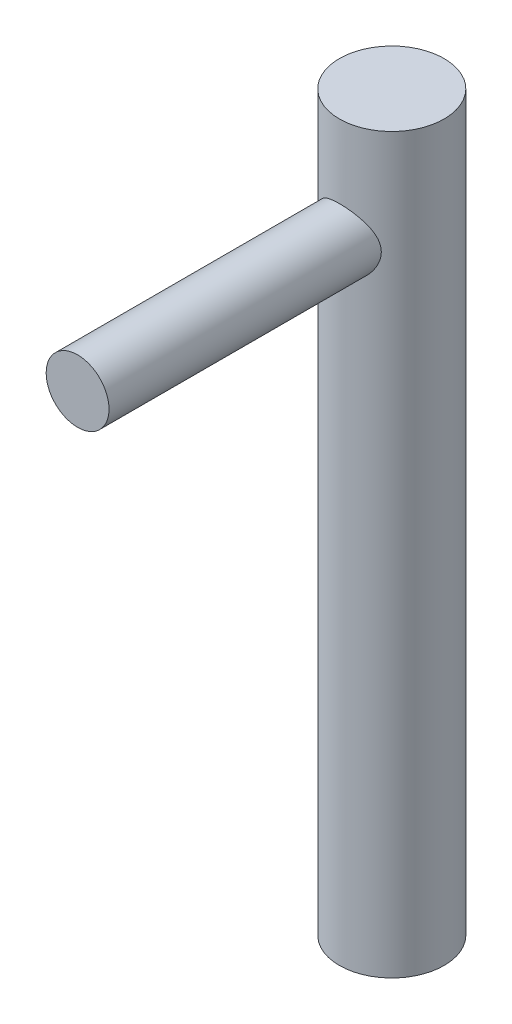
ISO-10303-21;
HEADER;
FILE_DESCRIPTION(('STEP AP214'),'2;1');
FILE_NAME('part.step','',(''),(''),'','','');
FILE_SCHEMA(('AUTOMOTIVE_DESIGN { 1 0 10303 214 1 1 1 1 }'));
ENDSEC;
DATA;
#1=APPLICATION_CONTEXT('core data for automotive mechanical design processes');
#2=APPLICATION_PROTOCOL_DEFINITION('international standard','automotive_design',2000,#1);
#3=PRODUCT_CONTEXT('',#1,'mechanical');
#4=PRODUCT('Part','Part','',(#3));
#5=PRODUCT_RELATED_PRODUCT_CATEGORY('part','',(#4));
#6=PRODUCT_DEFINITION_FORMATION('','',#4);
#7=PRODUCT_DEFINITION_CONTEXT('part definition',#1,'design');
#8=PRODUCT_DEFINITION('design','',#6,#7);
#9=PRODUCT_DEFINITION_SHAPE('','',#8);
#10=(LENGTH_UNIT() NAMED_UNIT(*) SI_UNIT(.MILLI.,.METRE.));
#11=(NAMED_UNIT(*) PLANE_ANGLE_UNIT() SI_UNIT($,.RADIAN.));
#12=(NAMED_UNIT(*) SI_UNIT($,.STERADIAN.) SOLID_ANGLE_UNIT());
#13=UNCERTAINTY_MEASURE_WITH_UNIT(LENGTH_MEASURE(1.E-05),#10,'distance_accuracy_value','');
#14=(GEOMETRIC_REPRESENTATION_CONTEXT(3) GLOBAL_UNCERTAINTY_ASSIGNED_CONTEXT((#13)) GLOBAL_UNIT_ASSIGNED_CONTEXT((#10,
#11,#12)) REPRESENTATION_CONTEXT('',''));
#15=CARTESIAN_POINT('',(0.,0.,0.));
#16=DIRECTION('',(0.,0.,1.));
#17=DIRECTION('',(1.,0.,0.));
#18=AXIS2_PLACEMENT_3D('',#15,#16,#17);
#19=CARTESIAN_POINT('',(0.,35.,0.));
#20=DIRECTION('',(0.,-1.,0.));
#21=DIRECTION('',(0.,0.,-1.));
#22=AXIS2_PLACEMENT_3D('',#19,#20,#21);
#23=CYLINDRICAL_SURFACE('',#22,2.5);
#24=CARTESIAN_POINT('',(0.,35.,0.));
#25=DIRECTION('',(0.,1.,0.));
#26=DIRECTION('',(0.,0.,1.));
#27=AXIS2_PLACEMENT_3D('',#24,#25,#26);
#28=CIRCLE('',#27,2.5);
#29=CARTESIAN_POINT('',(0.,35.,2.5));
#30=VERTEX_POINT('',#29);
#31=EDGE_CURVE('E46',#30,#30,#28,.T.);
#32=ORIENTED_EDGE('',*,*,#31,.F.);
#33=EDGE_LOOP('',(#32));
#34=FACE_BOUND('',#33,.T.);
#35=CARTESIAN_POINT('',(0.,0.,0.));
#36=DIRECTION('',(0.,1.,0.));
#37=DIRECTION('',(0.,0.,1.));
#38=AXIS2_PLACEMENT_3D('',#35,#36,#37);
#39=CIRCLE('',#38,2.5);
#40=CARTESIAN_POINT('',(0.,0.,2.5));
#41=VERTEX_POINT('',#40);
#42=EDGE_CURVE('E50',#41,#41,#39,.T.);
#43=ORIENTED_EDGE('',*,*,#42,.T.);
#44=EDGE_LOOP('',(#43));
#45=FACE_BOUND('',#44,.T.);
#46=CARTESIAN_POINT('',(-1.5,30.,2.));
#47=CARTESIAN_POINT('',(-1.50000404108592,29.9245210247104,1.99999416642511));
#48=CARTESIAN_POINT('',(-1.49426852824014,29.8490615659202,2.00433633903481));
#49=CARTESIAN_POINT('',(-1.47174965152788,29.7006760960378,2.02092590613883));
#50=CARTESIAN_POINT('',(-1.45495475788936,29.6277528126149,2.03318155043097));
#51=CARTESIAN_POINT('',(-1.41143486335796,29.4869163583227,2.0636233903473));
#52=CARTESIAN_POINT('',(-1.3847815450315,29.4189711619647,2.08176666183119));
#53=CARTESIAN_POINT('',(-1.3225290928302,29.2885625466321,2.12185904995836));
#54=CARTESIAN_POINT('',(-1.28692729054694,29.2261007703049,2.14380930122416));
#55=CARTESIAN_POINT('',(-1.20271292747644,29.1000509833359,2.19228594587542));
#56=CARTESIAN_POINT('',(-1.15304179435289,29.0372590428761,2.21904371037662));
#57=CARTESIAN_POINT('',(-1.04426801309985,28.9202352372583,2.2722622943106));
#58=CARTESIAN_POINT('',(-0.985158296729614,28.8660098483292,2.29872287517103));
#59=CARTESIAN_POINT('',(-0.851442367411702,28.7618661902903,2.35175567858734));
#60=CARTESIAN_POINT('',(-0.775851995162549,28.7130455363302,2.37803133577818));
#61=CARTESIAN_POINT('',(-0.615654228271659,28.6291902775556,2.42443786983179));
#62=CARTESIAN_POINT('',(-0.53105519662633,28.5941430258773,2.44457437988735));
#63=CARTESIAN_POINT('',(-0.363771406742665,28.5424040771873,2.4747098780044));
#64=CARTESIAN_POINT('',(-0.281674698130914,28.5242796390327,2.4854930393917));
#65=CARTESIAN_POINT('',(-0.114970509382707,28.5020571971369,2.49874939277545));
#66=CARTESIAN_POINT('',(-0.0303654624001526,28.4979460219999,2.50123038813307));
#67=CARTESIAN_POINT('',(0.12763728373731,28.5036137473425,2.49783372711539));
#68=CARTESIAN_POINT('',(0.201123832865635,28.5117335261693,2.49295437513726));
#69=CARTESIAN_POINT('',(0.345464269151768,28.5384797956481,2.47707997553857));
#70=CARTESIAN_POINT('',(0.416317961051202,28.5571070639072,2.46608447529309));
#71=CARTESIAN_POINT('',(0.55405678046908,28.6041655627038,2.43884907201719));
#72=CARTESIAN_POINT('',(0.620916491037618,28.632653061139,2.42257910450824));
#73=CARTESIAN_POINT('',(0.748988660115612,28.6983846162255,2.38609637638748));
#74=CARTESIAN_POINT('',(0.810199646208012,28.735630947059,2.36588259201812));
#75=CARTESIAN_POINT('',(0.933074267143201,28.8228390928045,2.32037925976362));
#76=CARTESIAN_POINT('',(0.993918663198194,28.8737883117357,2.2947718295215));
#77=CARTESIAN_POINT('',(1.10671465909275,28.9844041178602,2.24255554245601));
#78=CARTESIAN_POINT('',(1.1586540130834,29.0440825034745,2.21594536703375));
#79=CARTESIAN_POINT('',(1.25824837767417,29.1786534061636,2.16111075123945));
#80=CARTESIAN_POINT('',(1.30470933188632,29.2545075765395,2.13305661385124));
#81=CARTESIAN_POINT('',(1.38397217194232,29.4147062316366,2.08250879557267));
#82=CARTESIAN_POINT('',(1.41679921962189,29.4990347161256,2.0600049029882));
#83=CARTESIAN_POINT('',(1.46077497064843,29.6523936318954,2.02895865196731));
#84=CARTESIAN_POINT('',(1.47527903312665,29.7200406322966,2.01833888618315));
#85=CARTESIAN_POINT('',(1.49480872755284,29.8573736102995,2.00392150777558));
#86=CARTESIAN_POINT('',(1.49984538302907,29.9270571204846,2.00011596115116));
#87=CARTESIAN_POINT('',(1.50014781114183,30.0665516824357,1.99988914321323));
#88=CARTESIAN_POINT('',(1.49540004697659,30.1363627772152,2.00347810223984));
#89=CARTESIAN_POINT('',(1.47640290574941,30.2739873437486,2.01751520788652));
#90=CARTESIAN_POINT('',(1.4621460183014,30.3417991922403,2.02796877613213));
#91=CARTESIAN_POINT('',(1.42488312618657,30.4737145794798,2.054317683331));
#92=CARTESIAN_POINT('',(1.40188805257362,30.5378226365322,2.07020622092812));
#93=CARTESIAN_POINT('',(1.34796261057072,30.6614777157302,2.10571539417587));
#94=CARTESIAN_POINT('',(1.31702924888212,30.721023006366,2.12533743689999));
#95=CARTESIAN_POINT('',(1.24167439558512,30.8452400825123,2.17036819177737));
#96=CARTESIAN_POINT('',(1.19582663060302,30.9089008350966,2.19618239397369));
#97=CARTESIAN_POINT('',(1.09487395518701,31.0282854848495,2.24821754803621));
#98=CARTESIAN_POINT('',(1.03976018672402,31.0840016921691,2.27443886711455));
#99=CARTESIAN_POINT('',(0.913274837212766,31.1932240073504,2.32835625910913));
#100=CARTESIAN_POINT('',(0.84072110878019,31.2455007266058,2.3558007587587));
#101=CARTESIAN_POINT('',(0.686103100868017,31.3369027768367,2.40537639133459));
#102=CARTESIAN_POINT('',(0.6040451761347,31.3760368278409,2.42751104449411));
#103=CARTESIAN_POINT('',(0.438840232972136,31.4368682034314,2.46252280092775));
#104=CARTESIAN_POINT('',(0.356205963651256,31.4596262277911,2.47595588067329));
#105=CARTESIAN_POINT('',(0.187383063890855,31.4907146028463,2.494407389061));
#106=CARTESIAN_POINT('',(0.101198571781966,31.4990612907176,2.49943534582737));
#107=CARTESIAN_POINT('',(-0.0598120232009864,31.5006746085859,2.50040600461976));
#108=CARTESIAN_POINT('',(-0.134620583589708,31.495803334563,2.49747057186327));
#109=CARTESIAN_POINT('',(-0.282148755978776,31.4751061756184,2.48512948412095));
#110=CARTESIAN_POINT('',(-0.354868344701917,31.4592801686784,2.47572375706639));
#111=CARTESIAN_POINT('',(-0.4951454819788,31.4177804284162,2.45149427526962));
#112=CARTESIAN_POINT('',(-0.562767032608834,31.3922684038708,2.43675966858906));
#113=CARTESIAN_POINT('',(-0.692781971999989,31.3323594054452,2.40303337447155));
#114=CARTESIAN_POINT('',(-0.755174184199837,31.2979604391404,2.38404073252268));
#115=CARTESIAN_POINT('',(-0.880263645295951,31.2170748034312,2.3409343265938));
#116=CARTESIAN_POINT('',(-0.942258690439942,31.1696812909831,2.31648844639149));
#117=CARTESIAN_POINT('',(-1.05789751536307,31.0662469662823,2.26601907350661));
#118=CARTESIAN_POINT('',(-1.11153190956916,31.0101965743921,2.23999385274509));
#119=CARTESIAN_POINT('',(-1.2159097535057,30.8827144378223,2.18528165666204));
#120=CARTESIAN_POINT('',(-1.26542406663368,30.8102335138345,2.15667566270901));
#121=CARTESIAN_POINT('',(-1.35156817210325,30.6565151472335,2.10376464485145));
#122=CARTESIAN_POINT('',(-1.38820466322661,30.5752822860186,2.07945738811052));
#123=CARTESIAN_POINT('',(-1.44437116535132,30.4129357148628,2.0408000304796));
#124=CARTESIAN_POINT('',(-1.46509526060188,30.3324047640388,2.02577665830138));
#125=CARTESIAN_POINT('',(-1.49289268240427,30.1679026052963,2.00539032320036));
#126=CARTESIAN_POINT('',(-1.49999550595837,30.0839392342413,2.00000648744643));
#127=CARTESIAN_POINT('',(-1.5,30.,2.));
#128=B_SPLINE_CURVE_WITH_KNOTS('',3,(#46,#47,#48,#49,#50,#51,#52,#53,#54,#55,#56,#57,#58,#59,
#60,#61,#62,#63,#64,#65,#66,#67,#68,#69,#70,#71,#72,#73,#74,#75,#76,#77,#78,#79,#80,#81,#82,#83,
#84,#85,#86,#87,#88,#89,#90,#91,#92,#93,#94,#95,#96,#97,#98,#99,#100,#101,#102,#103,#104,#105,
#106,#107,#108,#109,#110,#111,#112,#113,#114,#115,#116,#117,#118,#119,#120,#121,#122,#123,#124,
#125,#126,#127),.UNSPECIFIED.,.T.,.F.,(4,2,2,2,2,2,2,2,2,2,2,2,2,2,2,2,2,2,2,2,2,2,2,2,2,2,2,2,
2,2,2,2,2,2,2,2,2,2,2,2,4),(0.,0.22608524949339,0.452406574330771,0.677113624991876,
0.90188776221593,1.15414462390001,1.40659128601844,1.68630157736223,1.9657544327122,
2.21853330858498,2.47107452602767,2.69230130543182,2.91354445887945,3.13607155036377,
3.35865648368879,3.60782810055849,3.85733966656909,4.13576671140277,4.41367760154769,
4.62276298054685,4.83160475643977,5.04073566011182,5.25003193304129,5.45906724365496,
5.66818149154662,5.91499438482003,6.16204457978455,6.4412182801159,6.72020638384849,
6.97891479383338,7.23732973022727,7.461293218494,7.68525920139649,7.90563970188757,
8.12606965394586,8.37042963549488,8.61506198741956,8.89071695766605,9.16622832484807,
9.41820120134355,9.66962780912278),.UNSPECIFIED.);
#129=CARTESIAN_POINT('',(-1.5,30.,2.));
#130=VERTEX_POINT('',#129);
#131=EDGE_CURVE('E10',#130,#130,#128,.T.);
#132=ORIENTED_EDGE('',*,*,#131,.F.);
#133=EDGE_LOOP('',(#132));
#134=FACE_BOUND('',#133,.T.);
#135=ADVANCED_FACE('F35',(#34,#45,#134),#23,.T.);
#136=CARTESIAN_POINT('',(0.,35.,0.));
#137=DIRECTION('',(0.,1.,0.));
#138=DIRECTION('',(0.,0.,1.));
#139=AXIS2_PLACEMENT_3D('',#136,#137,#138);
#140=PLANE('',#139);
#141=ORIENTED_EDGE('',*,*,#31,.T.);
#142=EDGE_LOOP('',(#141));
#143=FACE_BOUND('',#142,.T.);
#144=ADVANCED_FACE('F70',(#143),#140,.T.);
#145=CARTESIAN_POINT('',(0.,0.,0.));
#146=DIRECTION('',(0.,1.,0.));
#147=DIRECTION('',(0.,0.,1.));
#148=AXIS2_PLACEMENT_3D('',#145,#146,#147);
#149=PLANE('',#148);
#150=ORIENTED_EDGE('',*,*,#42,.F.);
#151=EDGE_LOOP('',(#150));
#152=FACE_BOUND('',#151,.T.);
#153=ADVANCED_FACE('F64',(#152),#149,.F.);
#154=CARTESIAN_POINT('',(0.,30.,15.));
#155=DIRECTION('',(0.,0.,-1.));
#156=DIRECTION('',(-1.,0.,0.));
#157=AXIS2_PLACEMENT_3D('',#154,#155,#156);
#158=CYLINDRICAL_SURFACE('',#157,1.5);
#159=CARTESIAN_POINT('',(0.,30.,15.));
#160=DIRECTION('',(0.,0.,1.));
#161=DIRECTION('',(1.,0.,0.));
#162=AXIS2_PLACEMENT_3D('',#159,#160,#161);
#163=CIRCLE('',#162,1.5);
#164=CARTESIAN_POINT('',(1.5,30.,15.));
#165=VERTEX_POINT('',#164);
#166=EDGE_CURVE('E55',#165,#165,#163,.T.);
#167=ORIENTED_EDGE('',*,*,#166,.F.);
#168=EDGE_LOOP('',(#167));
#169=FACE_BOUND('',#168,.T.);
#170=ORIENTED_EDGE('',*,*,#131,.T.);
#171=EDGE_LOOP('',(#170));
#172=FACE_BOUND('',#171,.T.);
#173=ADVANCED_FACE('F62',(#169,#172),#158,.T.);
#174=CARTESIAN_POINT('',(0.,30.,15.));
#175=DIRECTION('',(0.,0.,1.));
#176=DIRECTION('',(1.,0.,0.));
#177=AXIS2_PLACEMENT_3D('',#174,#175,#176);
#178=PLANE('',#177);
#179=ORIENTED_EDGE('',*,*,#166,.T.);
#180=EDGE_LOOP('',(#179));
#181=FACE_BOUND('',#180,.T.);
#182=ADVANCED_FACE('F60',(#181),#178,.T.);
#183=CLOSED_SHELL('',(#135,#144,#153,#173,#182));
#184=MANIFOLD_SOLID_BREP('B2',#183);
#185=ADVANCED_BREP_SHAPE_REPRESENTATION('',(#18,#184),#14);
#186=SHAPE_DEFINITION_REPRESENTATION(#9,#185);
ENDSEC;
END-ISO-10303-21;
